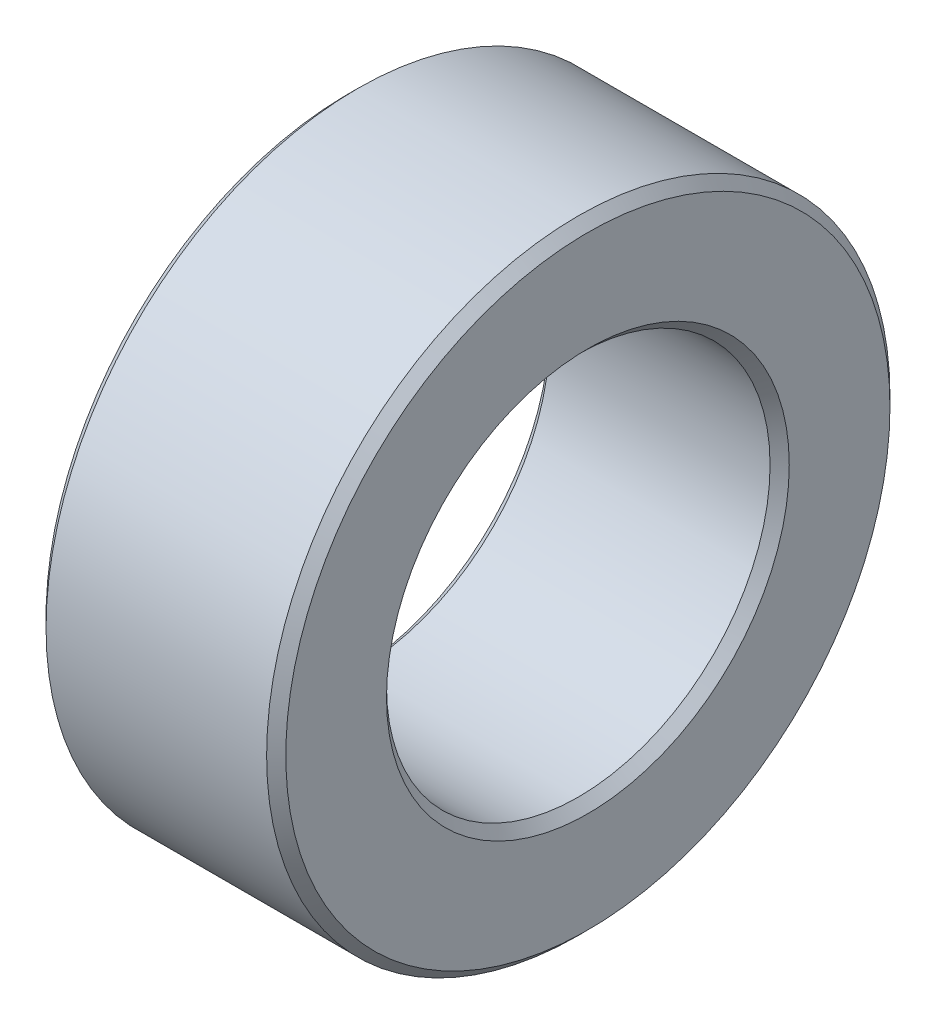
ISO-10303-21;
HEADER;
FILE_DESCRIPTION(('STEP AP214'),'2;1');
FILE_NAME('part.step','',(''),(''),'','','');
FILE_SCHEMA(('AUTOMOTIVE_DESIGN { 1 0 10303 214 1 1 1 1 }'));
ENDSEC;
DATA;
#1=APPLICATION_CONTEXT('core data for automotive mechanical design processes');
#2=APPLICATION_PROTOCOL_DEFINITION('international standard','automotive_design',2000,#1);
#3=PRODUCT_CONTEXT('',#1,'mechanical');
#4=PRODUCT('Part','Part','',(#3));
#5=PRODUCT_RELATED_PRODUCT_CATEGORY('part','',(#4));
#6=PRODUCT_DEFINITION_FORMATION('','',#4);
#7=PRODUCT_DEFINITION_CONTEXT('part definition',#1,'design');
#8=PRODUCT_DEFINITION('design','',#6,#7);
#9=PRODUCT_DEFINITION_SHAPE('','',#8);
#10=(LENGTH_UNIT() NAMED_UNIT(*) SI_UNIT(.MILLI.,.METRE.));
#11=(NAMED_UNIT(*) PLANE_ANGLE_UNIT() SI_UNIT($,.RADIAN.));
#12=(NAMED_UNIT(*) SI_UNIT($,.STERADIAN.) SOLID_ANGLE_UNIT());
#13=UNCERTAINTY_MEASURE_WITH_UNIT(LENGTH_MEASURE(1.E-05),#10,'distance_accuracy_value','');
#14=(GEOMETRIC_REPRESENTATION_CONTEXT(3) GLOBAL_UNCERTAINTY_ASSIGNED_CONTEXT((#13)) GLOBAL_UNIT_ASSIGNED_CONTEXT((#10,
#11,#12)) REPRESENTATION_CONTEXT('',''));
#15=CARTESIAN_POINT('',(0.,0.,0.));
#16=DIRECTION('',(0.,0.,1.));
#17=DIRECTION('',(1.,0.,0.));
#18=AXIS2_PLACEMENT_3D('',#15,#16,#17);
#19=CARTESIAN_POINT('',(5.,0.,0.));
#20=DIRECTION('',(1.,0.,0.));
#21=DIRECTION('',(0.,0.,-1.));
#22=AXIS2_PLACEMENT_3D('',#19,#20,#21);
#23=PLANE('',#22);
#24=CARTESIAN_POINT('',(5.,0.,0.));
#25=DIRECTION('',(1.,0.,0.));
#26=DIRECTION('',(0.,0.,-1.));
#27=AXIS2_PLACEMENT_3D('',#24,#25,#26);
#28=CIRCLE('',#27,4.2);
#29=CARTESIAN_POINT('',(5.,0.,-4.2));
#30=VERTEX_POINT('',#29);
#31=EDGE_CURVE('E10',#30,#30,#28,.F.);
#32=ORIENTED_EDGE('',*,*,#31,.T.);
#33=EDGE_LOOP('',(#32));
#34=FACE_BOUND('',#33,.T.);
#35=CARTESIAN_POINT('',(5.,0.,0.));
#36=DIRECTION('',(1.,0.,0.));
#37=DIRECTION('',(0.,0.,-1.));
#38=AXIS2_PLACEMENT_3D('',#35,#36,#37);
#39=CIRCLE('',#38,6.3);
#40=CARTESIAN_POINT('',(5.,0.,-6.3));
#41=VERTEX_POINT('',#40);
#42=EDGE_CURVE('E38',#41,#41,#39,.T.);
#43=ORIENTED_EDGE('',*,*,#42,.T.);
#44=EDGE_LOOP('',(#43));
#45=FACE_BOUND('',#44,.T.);
#46=ADVANCED_FACE('F31',(#34,#45),#23,.T.);
#47=CARTESIAN_POINT('',(0.,0.,0.));
#48=DIRECTION('',(1.,0.,0.));
#49=DIRECTION('',(0.,0.,-1.));
#50=AXIS2_PLACEMENT_3D('',#47,#48,#49);
#51=PLANE('',#50);
#52=CARTESIAN_POINT('',(0.,0.,0.));
#53=DIRECTION('',(1.,0.,0.));
#54=DIRECTION('',(0.,0.,-1.));
#55=AXIS2_PLACEMENT_3D('',#52,#53,#54);
#56=CIRCLE('',#55,4.2);
#57=CARTESIAN_POINT('',(0.,0.,-4.2));
#58=VERTEX_POINT('',#57);
#59=EDGE_CURVE('E57',#58,#58,#56,.T.);
#60=ORIENTED_EDGE('',*,*,#59,.T.);
#61=EDGE_LOOP('',(#60));
#62=FACE_BOUND('',#61,.T.);
#63=CARTESIAN_POINT('',(0.,0.,0.));
#64=DIRECTION('',(1.,0.,0.));
#65=DIRECTION('',(0.,0.,-1.));
#66=AXIS2_PLACEMENT_3D('',#63,#64,#65);
#67=CIRCLE('',#66,6.3);
#68=CARTESIAN_POINT('',(0.,0.,-6.3));
#69=VERTEX_POINT('',#68);
#70=EDGE_CURVE('E60',#69,#69,#67,.F.);
#71=ORIENTED_EDGE('',*,*,#70,.T.);
#72=EDGE_LOOP('',(#71));
#73=FACE_BOUND('',#72,.T.);
#74=ADVANCED_FACE('F64',(#62,#73),#51,.F.);
#75=CARTESIAN_POINT('',(5.,0.,0.));
#76=DIRECTION('',(-1.,0.,0.));
#77=DIRECTION('',(0.,0.,1.));
#78=AXIS2_PLACEMENT_3D('',#75,#76,#77);
#79=CYLINDRICAL_SURFACE('',#78,6.5);
#80=CARTESIAN_POINT('',(0.199999999999996,0.,0.));
#81=DIRECTION('',(1.,0.,0.));
#82=DIRECTION('',(0.,0.,-1.));
#83=AXIS2_PLACEMENT_3D('',#80,#81,#82);
#84=CIRCLE('',#83,6.5);
#85=CARTESIAN_POINT('',(0.199999999999996,0.,-6.5));
#86=VERTEX_POINT('',#85);
#87=EDGE_CURVE('E42',#86,#86,#84,.T.);
#88=ORIENTED_EDGE('',*,*,#87,.T.);
#89=EDGE_LOOP('',(#88));
#90=FACE_BOUND('',#89,.T.);
#91=CARTESIAN_POINT('',(4.8,0.,0.));
#92=DIRECTION('',(1.,0.,0.));
#93=DIRECTION('',(0.,0.,-1.));
#94=AXIS2_PLACEMENT_3D('',#91,#92,#93);
#95=CIRCLE('',#94,6.5);
#96=CARTESIAN_POINT('',(4.8,0.,-6.5));
#97=VERTEX_POINT('',#96);
#98=EDGE_CURVE('E46',#97,#97,#95,.F.);
#99=ORIENTED_EDGE('',*,*,#98,.T.);
#100=EDGE_LOOP('',(#99));
#101=FACE_BOUND('',#100,.T.);
#102=ADVANCED_FACE('F74',(#90,#101),#79,.T.);
#103=CARTESIAN_POINT('',(5.,0.,0.));
#104=DIRECTION('',(-1.,0.,0.));
#105=DIRECTION('',(0.,0.,1.));
#106=AXIS2_PLACEMENT_3D('',#103,#104,#105);
#107=CYLINDRICAL_SURFACE('',#106,4.);
#108=CARTESIAN_POINT('',(0.200000000000002,0.,0.));
#109=DIRECTION('',(1.,0.,0.));
#110=DIRECTION('',(0.,0.,-1.));
#111=AXIS2_PLACEMENT_3D('',#108,#109,#110);
#112=CIRCLE('',#111,4.);
#113=CARTESIAN_POINT('',(0.200000000000002,0.,-4.));
#114=VERTEX_POINT('',#113);
#115=EDGE_CURVE('E51',#114,#114,#112,.F.);
#116=ORIENTED_EDGE('',*,*,#115,.T.);
#117=EDGE_LOOP('',(#116));
#118=FACE_BOUND('',#117,.T.);
#119=CARTESIAN_POINT('',(4.8,0.,0.));
#120=DIRECTION('',(1.,0.,0.));
#121=DIRECTION('',(0.,0.,-1.));
#122=AXIS2_PLACEMENT_3D('',#119,#120,#121);
#123=CIRCLE('',#122,4.);
#124=CARTESIAN_POINT('',(4.8,0.,-4.));
#125=VERTEX_POINT('',#124);
#126=EDGE_CURVE('E54',#125,#125,#123,.T.);
#127=ORIENTED_EDGE('',*,*,#126,.T.);
#128=EDGE_LOOP('',(#127));
#129=FACE_BOUND('',#128,.T.);
#130=ADVANCED_FACE('F77',(#118,#129),#107,.F.);
#131=CARTESIAN_POINT('',(0.,0.,0.));
#132=DIRECTION('',(-1.,0.,0.));
#133=DIRECTION('',(0.,0.,1.));
#134=AXIS2_PLACEMENT_3D('',#131,#132,#133);
#135=CONICAL_SURFACE('',#134,4.2,0.785398163397444);
#136=ORIENTED_EDGE('',*,*,#115,.F.);
#137=EDGE_LOOP('',(#136));
#138=FACE_BOUND('',#137,.T.);
#139=ORIENTED_EDGE('',*,*,#59,.F.);
#140=EDGE_LOOP('',(#139));
#141=FACE_BOUND('',#140,.T.);
#142=ADVANCED_FACE('F70',(#138,#141),#135,.F.);
#143=CARTESIAN_POINT('',(0.199999999999996,0.,0.));
#144=DIRECTION('',(1.,0.,0.));
#145=DIRECTION('',(0.,0.,-1.));
#146=AXIS2_PLACEMENT_3D('',#143,#144,#145);
#147=CONICAL_SURFACE('',#146,6.5,0.78539816339745);
#148=ORIENTED_EDGE('',*,*,#70,.F.);
#149=EDGE_LOOP('',(#148));
#150=FACE_BOUND('',#149,.T.);
#151=ORIENTED_EDGE('',*,*,#87,.F.);
#152=EDGE_LOOP('',(#151));
#153=FACE_BOUND('',#152,.T.);
#154=ADVANCED_FACE('F66',(#150,#153),#147,.T.);
#155=CARTESIAN_POINT('',(4.8,0.,0.));
#156=DIRECTION('',(1.,0.,0.));
#157=DIRECTION('',(0.,0.,-1.));
#158=AXIS2_PLACEMENT_3D('',#155,#156,#157);
#159=CONICAL_SURFACE('',#158,4.,0.785398163397446);
#160=ORIENTED_EDGE('',*,*,#31,.F.);
#161=EDGE_LOOP('',(#160));
#162=FACE_BOUND('',#161,.T.);
#163=ORIENTED_EDGE('',*,*,#126,.F.);
#164=EDGE_LOOP('',(#163));
#165=FACE_BOUND('',#164,.T.);
#166=ADVANCED_FACE('F69',(#162,#165),#159,.F.);
#167=CARTESIAN_POINT('',(5.,0.,0.));
#168=DIRECTION('',(-1.,0.,0.));
#169=DIRECTION('',(0.,0.,1.));
#170=AXIS2_PLACEMENT_3D('',#167,#168,#169);
#171=CONICAL_SURFACE('',#170,6.3,0.785398163397448);
#172=ORIENTED_EDGE('',*,*,#98,.F.);
#173=EDGE_LOOP('',(#172));
#174=FACE_BOUND('',#173,.T.);
#175=ORIENTED_EDGE('',*,*,#42,.F.);
#176=EDGE_LOOP('',(#175));
#177=FACE_BOUND('',#176,.T.);
#178=ADVANCED_FACE('F33',(#174,#177),#171,.T.);
#179=CLOSED_SHELL('',(#46,#74,#102,#130,#142,#154,#166,#178));
#180=MANIFOLD_SOLID_BREP('B2',#179);
#181=ADVANCED_BREP_SHAPE_REPRESENTATION('',(#18,#180),#14);
#182=SHAPE_DEFINITION_REPRESENTATION(#9,#181);
ENDSEC;
END-ISO-10303-21;
